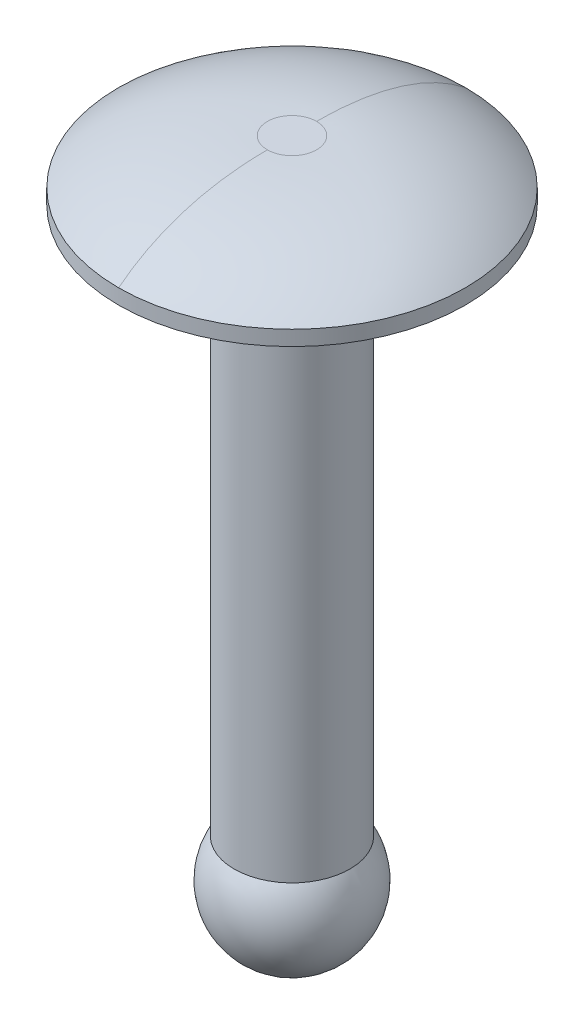
ISO-10303-21;
HEADER;
FILE_DESCRIPTION(('STEP AP214'),'2;1');
FILE_NAME('part.step','',(''),(''),'','','');
FILE_SCHEMA(('AUTOMOTIVE_DESIGN { 1 0 10303 214 1 1 1 1 }'));
ENDSEC;
DATA;
#1=APPLICATION_CONTEXT('core data for automotive mechanical design processes');
#2=APPLICATION_PROTOCOL_DEFINITION('international standard','automotive_design',2000,#1);
#3=PRODUCT_CONTEXT('',#1,'mechanical');
#4=PRODUCT('Part','Part','',(#3));
#5=PRODUCT_RELATED_PRODUCT_CATEGORY('part','',(#4));
#6=PRODUCT_DEFINITION_FORMATION('','',#4);
#7=PRODUCT_DEFINITION_CONTEXT('part definition',#1,'design');
#8=PRODUCT_DEFINITION('design','',#6,#7);
#9=PRODUCT_DEFINITION_SHAPE('','',#8);
#10=(LENGTH_UNIT() NAMED_UNIT(*) SI_UNIT(.MILLI.,.METRE.));
#11=(NAMED_UNIT(*) PLANE_ANGLE_UNIT() SI_UNIT($,.RADIAN.));
#12=(NAMED_UNIT(*) SI_UNIT($,.STERADIAN.) SOLID_ANGLE_UNIT());
#13=UNCERTAINTY_MEASURE_WITH_UNIT(LENGTH_MEASURE(1.E-05),#10,'distance_accuracy_value','');
#14=(GEOMETRIC_REPRESENTATION_CONTEXT(3) GLOBAL_UNCERTAINTY_ASSIGNED_CONTEXT((#13)) GLOBAL_UNIT_ASSIGNED_CONTEXT((#10,
#11,#12)) REPRESENTATION_CONTEXT('',''));
#15=CARTESIAN_POINT('',(0.,0.,0.));
#16=DIRECTION('',(0.,0.,1.));
#17=DIRECTION('',(1.,0.,0.));
#18=AXIS2_PLACEMENT_3D('',#15,#16,#17);
#19=CARTESIAN_POINT('',(0.,1.651,0.));
#20=DIRECTION('',(0.,1.,0.));
#21=DIRECTION('',(0.,0.,1.));
#22=AXIS2_PLACEMENT_3D('',#19,#20,#21);
#23=PLANE('',#22);
#24=CARTESIAN_POINT('',(0.,1.651,-0.67542581426094));
#25=CARTESIAN_POINT('',(1.35085162852188,1.651,-0.675425814260939));
#26=CARTESIAN_POINT('',(1.35085162852188,1.651,0.67542581426094));
#27=CARTESIAN_POINT('',(0.,1.651,0.67542581426094));
#28=(BOUNDED_CURVE() B_SPLINE_CURVE(3,(#24,#25,#26,#27),.UNSPECIFIED.,.F.,
.F.) B_SPLINE_CURVE_WITH_KNOTS((4,4),(0.,1.),
.UNSPECIFIED.) CURVE() GEOMETRIC_REPRESENTATION_ITEM() RATIONAL_B_SPLINE_CURVE((1.,
0.333333333333333,0.333333333333333,1.)) REPRESENTATION_ITEM(''));
#29=CARTESIAN_POINT('',(0.,1.651,0.67542581426092));
#30=VERTEX_POINT('',#29);
#31=CARTESIAN_POINT('',(0.,1.651,-0.67542581426092));
#32=VERTEX_POINT('',#31);
#33=EDGE_CURVE('E91',#30,#32,#28,.F.);
#34=ORIENTED_EDGE('',*,*,#33,.T.);
#35=CARTESIAN_POINT('',(0.,1.651,0.67542581426094));
#36=CARTESIAN_POINT('',(-1.35085162852188,1.651,0.675425814260939));
#37=CARTESIAN_POINT('',(-1.35085162852188,1.651,-0.675425814260941));
#38=CARTESIAN_POINT('',(0.,1.651,-0.67542581426094));
#39=(BOUNDED_CURVE() B_SPLINE_CURVE(3,(#35,#36,#37,#38),.UNSPECIFIED.,.F.,
.F.) B_SPLINE_CURVE_WITH_KNOTS((4,4),(0.,1.),
.UNSPECIFIED.) CURVE() GEOMETRIC_REPRESENTATION_ITEM() RATIONAL_B_SPLINE_CURVE((1.,
0.333333333333333,0.333333333333333,1.)) REPRESENTATION_ITEM(''));
#40=EDGE_CURVE('E62',#32,#30,#39,.F.);
#41=ORIENTED_EDGE('',*,*,#40,.T.);
#42=EDGE_LOOP('',(#34,#41));
#43=FACE_BOUND('',#42,.T.);
#44=ADVANCED_FACE('F17',(#43),#23,.T.);
#45=CARTESIAN_POINT('',(0.,0.412238092319749,4.7625));
#46=CARTESIAN_POINT('',(9.525,0.412238092319749,4.7625));
#47=CARTESIAN_POINT('',(9.525,0.412238092319749,-4.7625));
#48=CARTESIAN_POINT('',(0.,0.412238092319749,-4.7625));
#49=CARTESIAN_POINT('',(0.,1.32452807989022,3.60801731713718));
#50=CARTESIAN_POINT('',(7.21603463427437,1.32452807989022,3.60801731713718));
#51=CARTESIAN_POINT('',(7.21603463427437,1.32452807989022,-3.60801731713718));
#52=CARTESIAN_POINT('',(0.,1.32452807989022,-3.60801731713718));
#53=CARTESIAN_POINT('',(0.,1.651,2.13402886668027));
#54=CARTESIAN_POINT('',(4.26805773336053,1.651,2.13402886668027));
#55=CARTESIAN_POINT('',(4.26805773336053,1.651,-2.13402886668027));
#56=CARTESIAN_POINT('',(0.,1.651,-2.13402886668027));
#57=CARTESIAN_POINT('',(0.,1.651,0.67542581426092));
#58=CARTESIAN_POINT('',(1.35085162852184,1.651,0.67542581426092));
#59=CARTESIAN_POINT('',(1.35085162852184,1.651,-0.67542581426092));
#60=CARTESIAN_POINT('',(0.,1.651,-0.67542581426092));
#61=(BOUNDED_SURFACE() B_SPLINE_SURFACE(3,3,((#45,#46,#47,#48),(#49,#50,#51,#52),(#53,#54,#55,
#56),(#57,#58,#59,#60)),.UNSPECIFIED.,.F.,.F.,.F.) B_SPLINE_SURFACE_WITH_KNOTS((4,4),(4,4),(0.,
1.),(0.,1.),.UNSPECIFIED.) GEOMETRIC_REPRESENTATION_ITEM() RATIONAL_B_SPLINE_SURFACE(((1.,
0.333333333333333,0.333333333333333,1.),(1.,0.333333333333333,0.333333333333333,1.),(1.,
0.333333333333333,0.333333333333333,1.),(1.,0.333333333333333,0.333333333333333,1.))) REPRESENTATION_ITEM('') SURFACE());
#62=CARTESIAN_POINT('',(0.,0.412238092319749,-4.7625));
#63=CARTESIAN_POINT('',(0.,1.32452807989022,-3.60801731713718));
#64=CARTESIAN_POINT('',(0.,1.651,-2.13402886668027));
#65=CARTESIAN_POINT('',(0.,1.651,-0.67542581426092));
#66=B_SPLINE_CURVE_WITH_KNOTS('',3,(#62,#63,#64,#65),.UNSPECIFIED.,.F.,.F.,(4,4),(0.,1.),.UNSPECIFIED.);
#67=CARTESIAN_POINT('',(0.,0.412238092319749,-4.7625));
#68=VERTEX_POINT('',#67);
#69=EDGE_CURVE('E51',#68,#32,#66,.T.);
#70=CARTESIAN_POINT('',(0.,0.412238092319749,4.7625));
#71=CARTESIAN_POINT('',(0.,1.32452807989022,3.60801731713718));
#72=CARTESIAN_POINT('',(0.,1.651,2.13402886668027));
#73=CARTESIAN_POINT('',(0.,1.651,0.67542581426092));
#74=B_SPLINE_CURVE_WITH_KNOTS('',3,(#70,#71,#72,#73),.UNSPECIFIED.,.F.,.F.,(4,4),(0.,1.),.UNSPECIFIED.);
#75=CARTESIAN_POINT('',(0.,0.412238092319749,4.7625));
#76=VERTEX_POINT('',#75);
#77=EDGE_CURVE('E54',#30,#76,#74,.F.);
#78=CARTESIAN_POINT('',(0.,0.412238092319749,0.));
#79=DIRECTION('',(0.,-1.,0.));
#80=DIRECTION('',(0.,0.,-1.));
#81=AXIS2_PLACEMENT_3D('',#78,#79,#80);
#82=CIRCLE('',#81,4.7625);
#83=EDGE_CURVE('E47',#68,#76,#82,.T.);
#84=ORIENTED_EDGE('',*,*,#69,.T.);
#85=ORIENTED_EDGE('',*,*,#33,.F.);
#86=ORIENTED_EDGE('',*,*,#77,.T.);
#87=ORIENTED_EDGE('',*,*,#83,.F.);
#88=EDGE_LOOP('',(#84,#85,#86,#87));
#89=FACE_BOUND('',#88,.T.);
#90=ADVANCED_FACE('F49',(#89),#61,.F.);
#91=CARTESIAN_POINT('',(0.,0.412238092319749,-4.7625));
#92=CARTESIAN_POINT('',(-9.525,0.412238092319749,-4.76250000000001));
#93=CARTESIAN_POINT('',(-9.52500000000001,0.412238092319749,4.7625));
#94=CARTESIAN_POINT('',(0.,0.412238092319749,4.7625));
#95=CARTESIAN_POINT('',(0.,1.32452807989022,-3.60801731713718));
#96=CARTESIAN_POINT('',(-7.21603463427437,1.32452807989022,-3.60801731713719));
#97=CARTESIAN_POINT('',(-7.21603463427437,1.32452807989022,3.60801731713718));
#98=CARTESIAN_POINT('',(0.,1.32452807989022,3.60801731713718));
#99=CARTESIAN_POINT('',(0.,1.651,-2.13402886668027));
#100=CARTESIAN_POINT('',(-4.26805773336053,1.651,-2.13402886668027));
#101=CARTESIAN_POINT('',(-4.26805773336053,1.651,2.13402886668027));
#102=CARTESIAN_POINT('',(0.,1.651,2.13402886668027));
#103=CARTESIAN_POINT('',(0.,1.651,-0.67542581426092));
#104=CARTESIAN_POINT('',(-1.35085162852184,1.651,-0.675425814260921));
#105=CARTESIAN_POINT('',(-1.35085162852184,1.651,0.67542581426092));
#106=CARTESIAN_POINT('',(0.,1.651,0.67542581426092));
#107=(BOUNDED_SURFACE() B_SPLINE_SURFACE(3,3,((#91,#92,#93,#94),(#95,#96,#97,#98),(#99,#100,
#101,#102),(#103,#104,#105,#106)),.UNSPECIFIED.,.F.,.F.,.F.) B_SPLINE_SURFACE_WITH_KNOTS((4,4),
(4,4),(0.,1.),(0.,1.),
.UNSPECIFIED.) GEOMETRIC_REPRESENTATION_ITEM() RATIONAL_B_SPLINE_SURFACE(((1.,0.333333333333333,
0.333333333333333,1.),(1.,0.333333333333333,0.333333333333333,1.),(1.,0.333333333333333,
0.333333333333333,1.),(1.,0.333333333333333,0.333333333333333,1.))) REPRESENTATION_ITEM('') SURFACE());
#108=CARTESIAN_POINT('',(0.,0.412238092319749,0.));
#109=DIRECTION('',(0.,-1.,0.));
#110=DIRECTION('',(0.,0.,-1.));
#111=AXIS2_PLACEMENT_3D('',#108,#109,#110);
#112=CIRCLE('',#111,4.7625);
#113=EDGE_CURVE('E58',#76,#68,#112,.T.);
#114=ORIENTED_EDGE('',*,*,#113,.F.);
#115=ORIENTED_EDGE('',*,*,#77,.F.);
#116=ORIENTED_EDGE('',*,*,#40,.F.);
#117=ORIENTED_EDGE('',*,*,#69,.F.);
#118=EDGE_LOOP('',(#114,#115,#116,#117));
#119=FACE_BOUND('',#118,.T.);
#120=ADVANCED_FACE('F61',(#119),#107,.F.);
#121=CARTESIAN_POINT('',(0.,1.651,0.));
#122=DIRECTION('',(0.,-1.,0.));
#123=DIRECTION('',(0.,0.,-1.));
#124=AXIS2_PLACEMENT_3D('',#121,#122,#123);
#125=CYLINDRICAL_SURFACE('',#124,4.7625);
#126=ORIENTED_EDGE('',*,*,#83,.T.);
#127=ORIENTED_EDGE('',*,*,#113,.T.);
#128=EDGE_LOOP('',(#126,#127));
#129=FACE_BOUND('',#128,.T.);
#130=CARTESIAN_POINT('',(0.,0.,0.));
#131=DIRECTION('',(0.,-1.,0.));
#132=DIRECTION('',(0.,0.,-1.));
#133=AXIS2_PLACEMENT_3D('',#130,#131,#132);
#134=CIRCLE('',#133,4.7625);
#135=CARTESIAN_POINT('',(0.,0.,-4.7625));
#136=VERTEX_POINT('',#135);
#137=EDGE_CURVE('E21',#136,#136,#134,.F.);
#138=ORIENTED_EDGE('',*,*,#137,.T.);
#139=EDGE_LOOP('',(#138));
#140=FACE_BOUND('',#139,.T.);
#141=ADVANCED_FACE('F65',(#129,#140),#125,.T.);
#142=CARTESIAN_POINT('',(0.,-16.0530283709378,0.));
#143=DIRECTION('',(0.,0.,-1.));
#144=DIRECTION('',(0.,-1.,0.));
#145=AXIS2_PLACEMENT_3D('',#142,#143,#144);
#146=SPHERICAL_SURFACE('',#145,1.905);
#147=CARTESIAN_POINT('',(0.,-16.0530283709378,1.905));
#148=VERTEX_POINT('',#147);
#149=VERTEX_LOOP('',#148);
#150=FACE_BOUND('',#149,.T.);
#151=CARTESIAN_POINT('',(0.,-16.0530283709378,-1.905));
#152=VERTEX_POINT('',#151);
#153=VERTEX_LOOP('',#152);
#154=FACE_BOUND('',#153,.T.);
#155=CARTESIAN_POINT('',(0.,-15.,0.));
#156=DIRECTION('',(0.,1.,0.));
#157=DIRECTION('',(0.,0.,1.));
#158=AXIS2_PLACEMENT_3D('',#155,#156,#157);
#159=CIRCLE('',#158,1.5875);
#160=CARTESIAN_POINT('',(0.,-15.,1.5875));
#161=VERTEX_POINT('',#160);
#162=EDGE_CURVE('E27',#161,#161,#159,.T.);
#163=ORIENTED_EDGE('',*,*,#162,.F.);
#164=EDGE_LOOP('',(#163));
#165=FACE_BOUND('',#164,.T.);
#166=ADVANCED_FACE('F151',(#150,#154,#165),#146,.T.);
#167=CARTESIAN_POINT('',(0.,0.,0.));
#168=DIRECTION('',(0.,1.,0.));
#169=DIRECTION('',(0.,0.,1.));
#170=AXIS2_PLACEMENT_3D('',#167,#168,#169);
#171=PLANE('',#170);
#172=ORIENTED_EDGE('',*,*,#137,.F.);
#173=EDGE_LOOP('',(#172));
#174=FACE_BOUND('',#173,.T.);
#175=CARTESIAN_POINT('',(0.,0.,0.));
#176=DIRECTION('',(0.,1.,0.));
#177=DIRECTION('',(0.,0.,1.));
#178=AXIS2_PLACEMENT_3D('',#175,#176,#177);
#179=CIRCLE('',#178,1.5875);
#180=CARTESIAN_POINT('',(0.,0.,1.5875));
#181=VERTEX_POINT('',#180);
#182=EDGE_CURVE('E11',#181,#181,#179,.F.);
#183=ORIENTED_EDGE('',*,*,#182,.F.);
#184=EDGE_LOOP('',(#183));
#185=FACE_BOUND('',#184,.T.);
#186=ADVANCED_FACE('F153',(#174,#185),#171,.F.);
#187=CARTESIAN_POINT('',(0.,-15.,0.));
#188=DIRECTION('',(0.,1.,0.));
#189=DIRECTION('',(0.,0.,1.));
#190=AXIS2_PLACEMENT_3D('',#187,#188,#189);
#191=CYLINDRICAL_SURFACE('',#190,1.5875);
#192=ORIENTED_EDGE('',*,*,#182,.T.);
#193=EDGE_LOOP('',(#192));
#194=FACE_BOUND('',#193,.T.);
#195=ORIENTED_EDGE('',*,*,#162,.T.);
#196=EDGE_LOOP('',(#195));
#197=FACE_BOUND('',#196,.T.);
#198=ADVANCED_FACE('F149',(#194,#197),#191,.T.);
#199=CLOSED_SHELL('',(#44,#90,#120,#141,#166,#186,#198));
#200=MANIFOLD_SOLID_BREP('B1',#199);
#201=ADVANCED_BREP_SHAPE_REPRESENTATION('',(#18,#200),#14);
#202=SHAPE_DEFINITION_REPRESENTATION(#9,#201);
ENDSEC;
END-ISO-10303-21;
